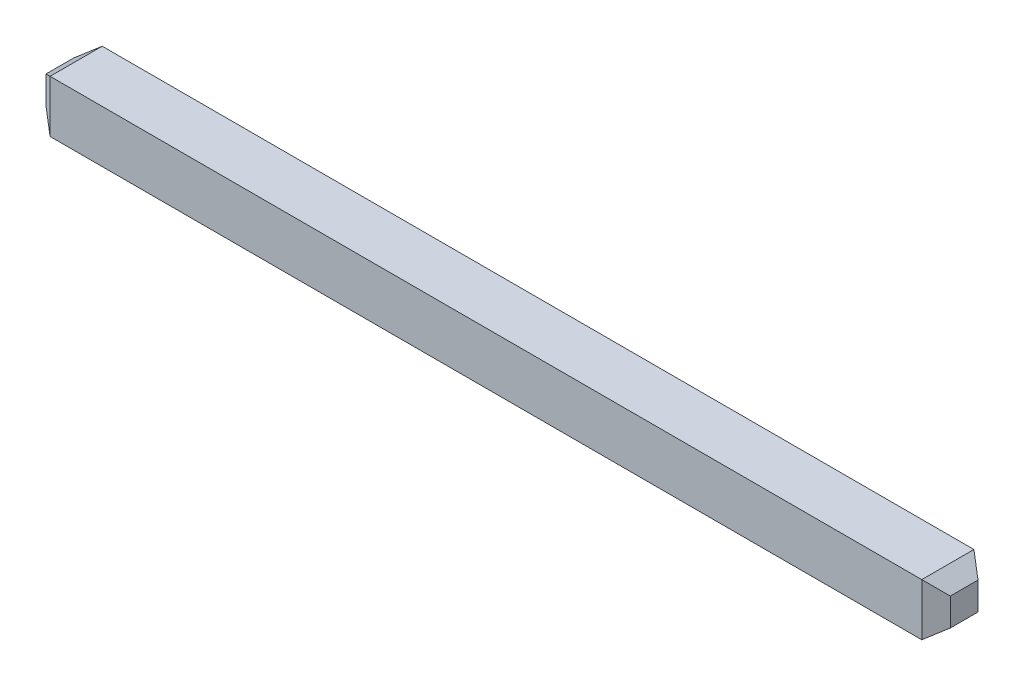
ISO-10303-21;
HEADER;
FILE_DESCRIPTION(('STEP AP214'),'2;1');
FILE_NAME('part.step','',(''),(''),'','','');
FILE_SCHEMA(('AUTOMOTIVE_DESIGN { 1 0 10303 214 1 1 1 1 }'));
ENDSEC;
DATA;
#1=APPLICATION_CONTEXT('core data for automotive mechanical design processes');
#2=APPLICATION_PROTOCOL_DEFINITION('international standard','automotive_design',2000,#1);
#3=PRODUCT_CONTEXT('',#1,'mechanical');
#4=PRODUCT('Part','Part','',(#3));
#5=PRODUCT_RELATED_PRODUCT_CATEGORY('part','',(#4));
#6=PRODUCT_DEFINITION_FORMATION('','',#4);
#7=PRODUCT_DEFINITION_CONTEXT('part definition',#1,'design');
#8=PRODUCT_DEFINITION('design','',#6,#7);
#9=PRODUCT_DEFINITION_SHAPE('','',#8);
#10=(LENGTH_UNIT() NAMED_UNIT(*) SI_UNIT(.MILLI.,.METRE.));
#11=(NAMED_UNIT(*) PLANE_ANGLE_UNIT() SI_UNIT($,.RADIAN.));
#12=(NAMED_UNIT(*) SI_UNIT($,.STERADIAN.) SOLID_ANGLE_UNIT());
#13=UNCERTAINTY_MEASURE_WITH_UNIT(LENGTH_MEASURE(1.E-05),#10,'distance_accuracy_value','');
#14=(GEOMETRIC_REPRESENTATION_CONTEXT(3) GLOBAL_UNCERTAINTY_ASSIGNED_CONTEXT((#13)) GLOBAL_UNIT_ASSIGNED_CONTEXT((#10,
#11,#12)) REPRESENTATION_CONTEXT('',''));
#15=CARTESIAN_POINT('',(0.,0.,0.));
#16=DIRECTION('',(0.,0.,1.));
#17=DIRECTION('',(1.,0.,0.));
#18=AXIS2_PLACEMENT_3D('',#15,#16,#17);
#19=CARTESIAN_POINT('',(-2.4,1.23,-47.235));
#20=DIRECTION('',(0.599999999990736,0.,0.800000000006948));
#21=DIRECTION('',(0.800000000006948,0.,-0.599999999990736));
#22=AXIS2_PLACEMENT_3D('',#19,#20,#21);
#23=PLANE('',#22);
#24=DIRECTION('',(0.,1.,0.));
#25=VECTOR('',#24,1.);
#26=CARTESIAN_POINT('',(-2.3,1.23,-47.31));
#27=LINE('',#26,#25);
#28=CARTESIAN_POINT('',(-2.29999999999956,1.55,-47.3099999999994));
#29=VERTEX_POINT('',#28);
#30=CARTESIAN_POINT('',(-2.29999999999957,0.909999999999898,-47.3099999999994));
#31=VERTEX_POINT('',#30);
#32=EDGE_CURVE('E101',#29,#31,#27,.F.);
#33=ORIENTED_EDGE('',*,*,#32,.T.);
#34=DIRECTION('',(-0.685994340569487,0.514495755428337,0.514495755427447));
#35=VECTOR('',#34,1.);
#36=CARTESIAN_POINT('',(-2.30000000000009,0.909999999999786,-47.31));
#37=LINE('',#36,#35);
#38=CARTESIAN_POINT('',(-2.50000000000021,1.06000000000001,-47.1600000000003));
#39=VERTEX_POINT('',#38);
#40=EDGE_CURVE('E85',#31,#39,#37,.T.);
#41=ORIENTED_EDGE('',*,*,#40,.T.);
#42=DIRECTION('',(0.,1.,0.));
#43=VECTOR('',#42,1.);
#44=CARTESIAN_POINT('',(-2.5,1.23,-47.16));
#45=LINE('',#44,#43);
#46=CARTESIAN_POINT('',(-2.50000000000043,1.4,-47.1600000000006));
#47=VERTEX_POINT('',#46);
#48=EDGE_CURVE('E79',#39,#47,#45,.T.);
#49=ORIENTED_EDGE('',*,*,#48,.T.);
#50=DIRECTION('',(-0.68599434057003,-0.514495755427523,0.514495755427537));
#51=VECTOR('',#50,1.);
#52=CARTESIAN_POINT('',(-2.3,1.55,-47.31));
#53=LINE('',#52,#51);
#54=EDGE_CURVE('E20',#29,#47,#53,.T.);
#55=ORIENTED_EDGE('',*,*,#54,.F.);
#56=EDGE_LOOP('',(#33,#41,#49,#55));
#57=FACE_BOUND('',#56,.T.);
#58=ADVANCED_FACE('F17',(#57),#23,.F.);
#59=CARTESIAN_POINT('',(8.5,1.23,-47.235));
#60=DIRECTION('',(-0.599999999990736,0.,0.800000000006948));
#61=DIRECTION('',(0.800000000006948,0.,0.599999999990736));
#62=AXIS2_PLACEMENT_3D('',#59,#60,#61);
#63=PLANE('',#62);
#64=DIRECTION('',(0.,1.,0.));
#65=VECTOR('',#64,1.);
#66=CARTESIAN_POINT('',(8.6,1.23,-47.16));
#67=LINE('',#66,#65);
#68=CARTESIAN_POINT('',(8.6000000000002,1.06000000000003,-47.1600000000003));
#69=VERTEX_POINT('',#68);
#70=CARTESIAN_POINT('',(8.60000000000043,1.4,-47.1600000000006));
#71=VERTEX_POINT('',#70);
#72=EDGE_CURVE('E113',#69,#71,#67,.T.);
#73=ORIENTED_EDGE('',*,*,#72,.F.);
#74=DIRECTION('',(-0.685994340569488,-0.514495755428337,-0.514495755427446));
#75=VECTOR('',#74,1.);
#76=CARTESIAN_POINT('',(8.59999999999996,1.06000000000005,-47.16));
#77=LINE('',#76,#75);
#78=CARTESIAN_POINT('',(8.39999999999958,0.909999999999884,-47.3099999999994));
#79=VERTEX_POINT('',#78);
#80=EDGE_CURVE('E108',#69,#79,#77,.T.);
#81=ORIENTED_EDGE('',*,*,#80,.T.);
#82=DIRECTION('',(0.,1.,0.));
#83=VECTOR('',#82,1.);
#84=CARTESIAN_POINT('',(8.4,1.23,-47.31));
#85=LINE('',#84,#83);
#86=CARTESIAN_POINT('',(8.39999999999956,1.55,-47.3099999999994));
#87=VERTEX_POINT('',#86);
#88=EDGE_CURVE('E99',#79,#87,#85,.T.);
#89=ORIENTED_EDGE('',*,*,#88,.T.);
#90=DIRECTION('',(-0.685994340570029,0.514495755427522,-0.51449575542754));
#91=VECTOR('',#90,1.);
#92=CARTESIAN_POINT('',(8.6,1.4,-47.16));
#93=LINE('',#92,#91);
#94=EDGE_CURVE('E116',#71,#87,#93,.T.);
#95=ORIENTED_EDGE('',*,*,#94,.F.);
#96=EDGE_LOOP('',(#73,#81,#89,#95));
#97=FACE_BOUND('',#96,.T.);
#98=ADVANCED_FACE('F214',(#97),#63,.F.);
#99=CARTESIAN_POINT('',(-2.4,1.475,-46.99));
#100=DIRECTION('',(-0.6,0.8,0.));
#101=DIRECTION('',(-0.8,-0.6,0.));
#102=AXIS2_PLACEMENT_3D('',#99,#100,#101);
#103=PLANE('',#102);
#104=DIRECTION('',(-0.685994340575993,-0.514495755427534,-0.514495755419575));
#105=VECTOR('',#104,1.);
#106=CARTESIAN_POINT('',(-2.29999999999913,1.55,-46.6700000000012));
#107=LINE('',#106,#105);
#108=CARTESIAN_POINT('',(-2.29999999999989,1.55,-46.6700000000002));
#109=VERTEX_POINT('',#108);
#110=CARTESIAN_POINT('',(-2.50000000000022,1.4,-46.8199999999997));
#111=VERTEX_POINT('',#110);
#112=EDGE_CURVE('E128',#109,#111,#107,.T.);
#113=ORIENTED_EDGE('',*,*,#112,.F.);
#114=DIRECTION('',(0.,0.,1.));
#115=VECTOR('',#114,1.);
#116=CARTESIAN_POINT('',(-2.3,1.55,-46.99));
#117=LINE('',#116,#115);
#118=EDGE_CURVE('E93',#29,#109,#117,.T.);
#119=ORIENTED_EDGE('',*,*,#118,.F.);
#120=ORIENTED_EDGE('',*,*,#54,.T.);
#121=DIRECTION('',(0.,0.,-1.));
#122=VECTOR('',#121,1.);
#123=CARTESIAN_POINT('',(-2.5,1.4,-46.99));
#124=LINE('',#123,#122);
#125=EDGE_CURVE('E87',#47,#111,#124,.F.);
#126=ORIENTED_EDGE('',*,*,#125,.T.);
#127=EDGE_LOOP('',(#113,#119,#120,#126));
#128=FACE_BOUND('',#127,.T.);
#129=ADVANCED_FACE('F90',(#128),#103,.T.);
#130=CARTESIAN_POINT('',(-2.5,1.23,-46.99));
#131=DIRECTION('',(1.,0.,0.));
#132=DIRECTION('',(0.,0.,-1.));
#133=AXIS2_PLACEMENT_3D('',#130,#131,#132);
#134=PLANE('',#133);
#135=DIRECTION('',(0.,1.,0.));
#136=VECTOR('',#135,1.);
#137=CARTESIAN_POINT('',(-2.50000000000087,1.23,-46.8199999999988));
#138=LINE('',#137,#136);
#139=CARTESIAN_POINT('',(-2.50000000000021,1.06000000000001,-46.8199999999997));
#140=VERTEX_POINT('',#139);
#141=EDGE_CURVE('E97',#111,#140,#138,.F.);
#142=ORIENTED_EDGE('',*,*,#141,.F.);
#143=ORIENTED_EDGE('',*,*,#125,.F.);
#144=ORIENTED_EDGE('',*,*,#48,.F.);
#145=DIRECTION('',(0.,0.,1.));
#146=VECTOR('',#145,1.);
#147=CARTESIAN_POINT('',(-2.49999999999996,1.06000000000005,-46.99));
#148=LINE('',#147,#146);
#149=EDGE_CURVE('E105',#39,#140,#148,.T.);
#150=ORIENTED_EDGE('',*,*,#149,.T.);
#151=EDGE_LOOP('',(#142,#143,#144,#150));
#152=FACE_BOUND('',#151,.T.);
#153=ADVANCED_FACE('F95',(#152),#134,.F.);
#154=CARTESIAN_POINT('',(3.05,1.23,-47.31));
#155=DIRECTION('',(0.,0.,1.));
#156=DIRECTION('',(1.,0.,0.));
#157=AXIS2_PLACEMENT_3D('',#154,#155,#156);
#158=PLANE('',#157);
#159=ORIENTED_EDGE('',*,*,#32,.F.);
#160=DIRECTION('',(1.,0.,0.));
#161=VECTOR('',#160,1.);
#162=CARTESIAN_POINT('',(3.05,1.55,-47.31));
#163=LINE('',#162,#161);
#164=EDGE_CURVE('E122',#87,#29,#163,.F.);
#165=ORIENTED_EDGE('',*,*,#164,.F.);
#166=ORIENTED_EDGE('',*,*,#88,.F.);
#167=DIRECTION('',(1.,0.,0.));
#168=VECTOR('',#167,1.);
#169=CARTESIAN_POINT('',(3.05,0.91,-47.31));
#170=LINE('',#169,#168);
#171=EDGE_CURVE('E136',#79,#31,#170,.F.);
#172=ORIENTED_EDGE('',*,*,#171,.T.);
#173=EDGE_LOOP('',(#159,#165,#166,#172));
#174=FACE_BOUND('',#173,.T.);
#175=ADVANCED_FACE('F182',(#174),#158,.F.);
#176=CARTESIAN_POINT('',(-2.4,0.9849999999999,-46.99));
#177=DIRECTION('',(0.600000000000912,0.799999999999316,0.));
#178=DIRECTION('',(-0.799999999999316,0.600000000000912,0.));
#179=AXIS2_PLACEMENT_3D('',#176,#177,#178);
#180=PLANE('',#179);
#181=DIRECTION('',(0.,0.,1.));
#182=VECTOR('',#181,1.);
#183=CARTESIAN_POINT('',(-2.3,0.91,-46.99));
#184=LINE('',#183,#182);
#185=CARTESIAN_POINT('',(-2.29999999999983,0.909999999999856,-46.6700000000003));
#186=VERTEX_POINT('',#185);
#187=EDGE_CURVE('E139',#31,#186,#184,.T.);
#188=ORIENTED_EDGE('',*,*,#187,.T.);
#189=DIRECTION('',(0.685994340575871,-0.514495755427787,0.514495755419485));
#190=VECTOR('',#189,1.);
#191=CARTESIAN_POINT('',(-2.50000000000087,1.06,-46.8199999999988));
#192=LINE('',#191,#190);
#193=EDGE_CURVE('E131',#140,#186,#192,.T.);
#194=ORIENTED_EDGE('',*,*,#193,.F.);
#195=ORIENTED_EDGE('',*,*,#149,.F.);
#196=ORIENTED_EDGE('',*,*,#40,.F.);
#197=EDGE_LOOP('',(#188,#194,#195,#196));
#198=FACE_BOUND('',#197,.T.);
#199=ADVANCED_FACE('F179',(#198),#180,.F.);
#200=CARTESIAN_POINT('',(8.5,0.9849999999999,-46.99));
#201=DIRECTION('',(-0.600000000000912,0.799999999999316,0.));
#202=DIRECTION('',(-0.799999999999316,-0.600000000000912,0.));
#203=AXIS2_PLACEMENT_3D('',#200,#201,#202);
#204=PLANE('',#203);
#205=DIRECTION('',(0.,0.,-1.));
#206=VECTOR('',#205,1.);
#207=CARTESIAN_POINT('',(8.6,1.06,-46.99));
#208=LINE('',#207,#206);
#209=CARTESIAN_POINT('',(8.6000000000002,1.06000000000003,-46.8199999999997));
#210=VERTEX_POINT('',#209);
#211=EDGE_CURVE('E110',#210,#69,#208,.T.);
#212=ORIENTED_EDGE('',*,*,#211,.F.);
#213=DIRECTION('',(0.685994340575871,0.514495755427787,-0.514495755419485));
#214=VECTOR('',#213,1.);
#215=CARTESIAN_POINT('',(8.39999999999913,0.9099999999999,-46.6700000000012));
#216=LINE('',#215,#214);
#217=CARTESIAN_POINT('',(8.39999999999993,0.909999999999868,-46.6700000000002));
#218=VERTEX_POINT('',#217);
#219=EDGE_CURVE('E35',#218,#210,#216,.T.);
#220=ORIENTED_EDGE('',*,*,#219,.F.);
#221=DIRECTION('',(0.,0.,1.));
#222=VECTOR('',#221,1.);
#223=CARTESIAN_POINT('',(8.4,0.91,-46.99));
#224=LINE('',#223,#222);
#225=EDGE_CURVE('E134',#218,#79,#224,.F.);
#226=ORIENTED_EDGE('',*,*,#225,.T.);
#227=ORIENTED_EDGE('',*,*,#80,.F.);
#228=EDGE_LOOP('',(#212,#220,#226,#227));
#229=FACE_BOUND('',#228,.T.);
#230=ADVANCED_FACE('F181',(#229),#204,.F.);
#231=CARTESIAN_POINT('',(8.6,1.23,-46.99));
#232=DIRECTION('',(1.,0.,0.));
#233=DIRECTION('',(0.,0.,-1.));
#234=AXIS2_PLACEMENT_3D('',#231,#232,#233);
#235=PLANE('',#234);
#236=ORIENTED_EDGE('',*,*,#72,.T.);
#237=DIRECTION('',(0.,0.,1.));
#238=VECTOR('',#237,1.);
#239=CARTESIAN_POINT('',(8.6,1.4,-46.99));
#240=LINE('',#239,#238);
#241=CARTESIAN_POINT('',(8.60000000000022,1.4,-46.8199999999997));
#242=VERTEX_POINT('',#241);
#243=EDGE_CURVE('E119',#242,#71,#240,.F.);
#244=ORIENTED_EDGE('',*,*,#243,.F.);
#245=DIRECTION('',(0.,1.,0.));
#246=VECTOR('',#245,1.);
#247=CARTESIAN_POINT('',(8.60000000000087,1.23,-46.8199999999988));
#248=LINE('',#247,#246);
#249=EDGE_CURVE('E142',#210,#242,#248,.T.);
#250=ORIENTED_EDGE('',*,*,#249,.F.);
#251=ORIENTED_EDGE('',*,*,#211,.T.);
#252=EDGE_LOOP('',(#236,#244,#250,#251));
#253=FACE_BOUND('',#252,.T.);
#254=ADVANCED_FACE('F189',(#253),#235,.T.);
#255=CARTESIAN_POINT('',(8.5,1.475,-46.99));
#256=DIRECTION('',(0.6,0.8,0.));
#257=DIRECTION('',(-0.8,0.6,0.));
#258=AXIS2_PLACEMENT_3D('',#255,#256,#257);
#259=PLANE('',#258);
#260=DIRECTION('',(-0.685994340575992,0.514495755427535,0.514495755419576));
#261=VECTOR('',#260,1.);
#262=CARTESIAN_POINT('',(8.60000000000087,1.4,-46.8199999999988));
#263=LINE('',#262,#261);
#264=CARTESIAN_POINT('',(8.39999999999989,1.55,-46.6700000000002));
#265=VERTEX_POINT('',#264);
#266=EDGE_CURVE('E145',#242,#265,#263,.T.);
#267=ORIENTED_EDGE('',*,*,#266,.F.);
#268=ORIENTED_EDGE('',*,*,#243,.T.);
#269=ORIENTED_EDGE('',*,*,#94,.T.);
#270=DIRECTION('',(0.,0.,1.));
#271=VECTOR('',#270,1.);
#272=CARTESIAN_POINT('',(8.4,1.55,-46.99));
#273=LINE('',#272,#271);
#274=EDGE_CURVE('E125',#265,#87,#273,.F.);
#275=ORIENTED_EDGE('',*,*,#274,.F.);
#276=EDGE_LOOP('',(#267,#268,#269,#275));
#277=FACE_BOUND('',#276,.T.);
#278=ADVANCED_FACE('F170',(#277),#259,.T.);
#279=CARTESIAN_POINT('',(3.05,1.55,-46.99));
#280=DIRECTION('',(0.,1.,0.));
#281=DIRECTION('',(0.,0.,1.));
#282=AXIS2_PLACEMENT_3D('',#279,#280,#281);
#283=PLANE('',#282);
#284=DIRECTION('',(1.,0.,0.));
#285=VECTOR('',#284,1.);
#286=CARTESIAN_POINT('',(3.05,1.55,-46.67));
#287=LINE('',#286,#285);
#288=EDGE_CURVE('E148',#265,#109,#287,.F.);
#289=ORIENTED_EDGE('',*,*,#288,.F.);
#290=ORIENTED_EDGE('',*,*,#274,.T.);
#291=ORIENTED_EDGE('',*,*,#164,.T.);
#292=ORIENTED_EDGE('',*,*,#118,.T.);
#293=EDGE_LOOP('',(#289,#290,#291,#292));
#294=FACE_BOUND('',#293,.T.);
#295=ADVANCED_FACE('F173',(#294),#283,.T.);
#296=CARTESIAN_POINT('',(-2.4,1.23,-46.745));
#297=DIRECTION('',(-0.599999999990736,0.,0.800000000006948));
#298=DIRECTION('',(0.800000000006948,0.,0.599999999990736));
#299=AXIS2_PLACEMENT_3D('',#296,#297,#298);
#300=PLANE('',#299);
#301=ORIENTED_EDGE('',*,*,#193,.T.);
#302=DIRECTION('',(0.,1.,0.));
#303=VECTOR('',#302,1.);
#304=CARTESIAN_POINT('',(-2.3,1.23,-46.67));
#305=LINE('',#304,#303);
#306=EDGE_CURVE('E151',#109,#186,#305,.F.);
#307=ORIENTED_EDGE('',*,*,#306,.F.);
#308=ORIENTED_EDGE('',*,*,#112,.T.);
#309=ORIENTED_EDGE('',*,*,#141,.T.);
#310=EDGE_LOOP('',(#301,#307,#308,#309));
#311=FACE_BOUND('',#310,.T.);
#312=ADVANCED_FACE('F176',(#311),#300,.T.);
#313=CARTESIAN_POINT('',(3.05,0.91,-46.99));
#314=DIRECTION('',(0.,1.,0.));
#315=DIRECTION('',(0.,0.,1.));
#316=AXIS2_PLACEMENT_3D('',#313,#314,#315);
#317=PLANE('',#316);
#318=ORIENTED_EDGE('',*,*,#187,.F.);
#319=ORIENTED_EDGE('',*,*,#171,.F.);
#320=ORIENTED_EDGE('',*,*,#225,.F.);
#321=DIRECTION('',(1.,0.,0.));
#322=VECTOR('',#321,1.);
#323=CARTESIAN_POINT('',(3.05,0.9099999999999,-46.67));
#324=LINE('',#323,#322);
#325=EDGE_CURVE('E26',#186,#218,#324,.T.);
#326=ORIENTED_EDGE('',*,*,#325,.F.);
#327=EDGE_LOOP('',(#318,#319,#320,#326));
#328=FACE_BOUND('',#327,.T.);
#329=ADVANCED_FACE('F162',(#328),#317,.F.);
#330=CARTESIAN_POINT('',(8.5,1.23,-46.745));
#331=DIRECTION('',(0.599999999990736,0.,0.800000000006948));
#332=DIRECTION('',(0.800000000006948,0.,-0.599999999990736));
#333=AXIS2_PLACEMENT_3D('',#330,#331,#332);
#334=PLANE('',#333);
#335=ORIENTED_EDGE('',*,*,#266,.T.);
#336=DIRECTION('',(0.,1.,0.));
#337=VECTOR('',#336,1.);
#338=CARTESIAN_POINT('',(8.4,1.23,-46.67));
#339=LINE('',#338,#337);
#340=EDGE_CURVE('E11',#218,#265,#339,.T.);
#341=ORIENTED_EDGE('',*,*,#340,.F.);
#342=ORIENTED_EDGE('',*,*,#219,.T.);
#343=ORIENTED_EDGE('',*,*,#249,.T.);
#344=EDGE_LOOP('',(#335,#341,#342,#343));
#345=FACE_BOUND('',#344,.T.);
#346=ADVANCED_FACE('F166',(#345),#334,.T.);
#347=CARTESIAN_POINT('',(3.05,1.23,-46.67));
#348=DIRECTION('',(0.,0.,1.));
#349=DIRECTION('',(1.,0.,0.));
#350=AXIS2_PLACEMENT_3D('',#347,#348,#349);
#351=PLANE('',#350);
#352=ORIENTED_EDGE('',*,*,#325,.T.);
#353=ORIENTED_EDGE('',*,*,#340,.T.);
#354=ORIENTED_EDGE('',*,*,#288,.T.);
#355=ORIENTED_EDGE('',*,*,#306,.T.);
#356=EDGE_LOOP('',(#352,#353,#354,#355));
#357=FACE_BOUND('',#356,.T.);
#358=ADVANCED_FACE('F157',(#357),#351,.T.);
#359=CLOSED_SHELL('',(#58,#98,#129,#153,#175,#199,#230,#254,#278,#295,#312,#329,#346,#358));
#360=MANIFOLD_SOLID_BREP('B1',#359);
#361=ADVANCED_BREP_SHAPE_REPRESENTATION('',(#18,#360),#14);
#362=SHAPE_DEFINITION_REPRESENTATION(#9,#361);
ENDSEC;
END-ISO-10303-21;
